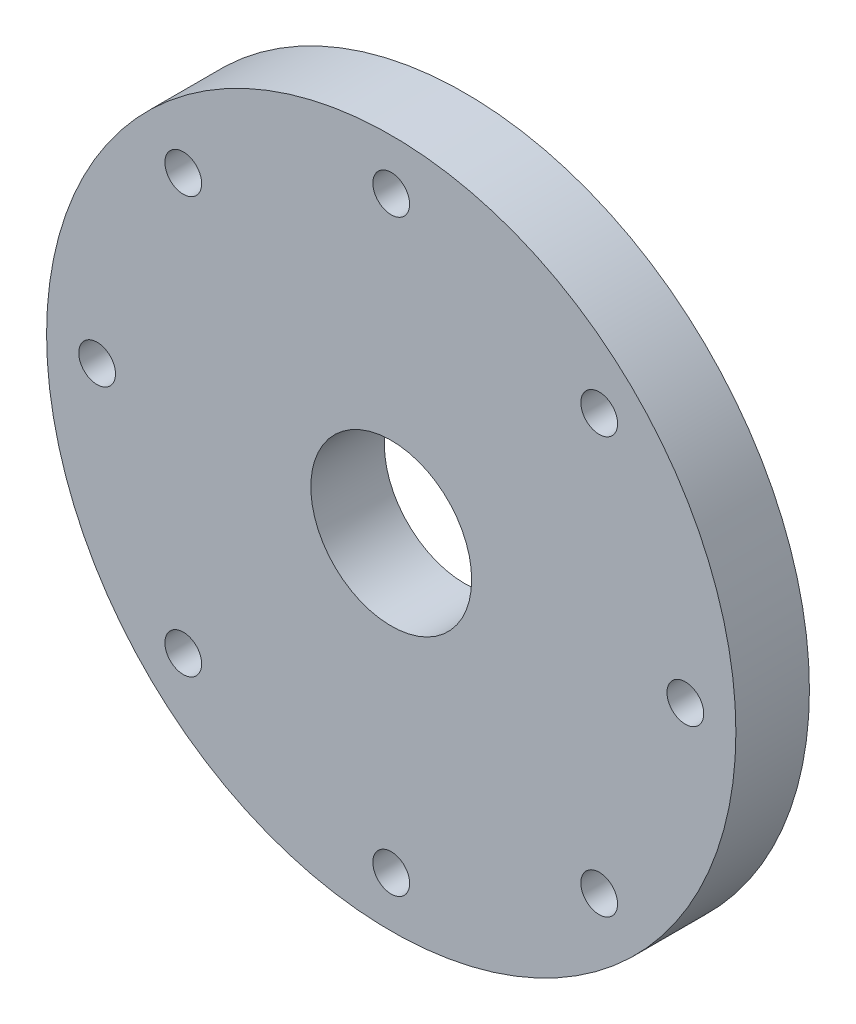
ISO-10303-21;
HEADER;
FILE_DESCRIPTION(('STEP AP214'),'2;1');
FILE_NAME('part.step','',(''),(''),'','','');
FILE_SCHEMA(('AUTOMOTIVE_DESIGN { 1 0 10303 214 1 1 1 1 }'));
ENDSEC;
DATA;
#1=APPLICATION_CONTEXT('core data for automotive mechanical design processes');
#2=APPLICATION_PROTOCOL_DEFINITION('international standard','automotive_design',2000,#1);
#3=PRODUCT_CONTEXT('',#1,'mechanical');
#4=PRODUCT('Part','Part','',(#3));
#5=PRODUCT_RELATED_PRODUCT_CATEGORY('part','',(#4));
#6=PRODUCT_DEFINITION_FORMATION('','',#4);
#7=PRODUCT_DEFINITION_CONTEXT('part definition',#1,'design');
#8=PRODUCT_DEFINITION('design','',#6,#7);
#9=PRODUCT_DEFINITION_SHAPE('','',#8);
#10=(LENGTH_UNIT() NAMED_UNIT(*) SI_UNIT(.MILLI.,.METRE.));
#11=(NAMED_UNIT(*) PLANE_ANGLE_UNIT() SI_UNIT($,.RADIAN.));
#12=(NAMED_UNIT(*) SI_UNIT($,.STERADIAN.) SOLID_ANGLE_UNIT());
#13=UNCERTAINTY_MEASURE_WITH_UNIT(LENGTH_MEASURE(1.E-05),#10,'distance_accuracy_value','');
#14=(GEOMETRIC_REPRESENTATION_CONTEXT(3) GLOBAL_UNCERTAINTY_ASSIGNED_CONTEXT((#13)) GLOBAL_UNIT_ASSIGNED_CONTEXT((#10,
#11,#12)) REPRESENTATION_CONTEXT('',''));
#15=CARTESIAN_POINT('',(0.,0.,0.));
#16=DIRECTION('',(0.,0.,1.));
#17=DIRECTION('',(1.,0.,0.));
#18=AXIS2_PLACEMENT_3D('',#15,#16,#17);
#19=CARTESIAN_POINT('',(0.,0.,14.));
#20=DIRECTION('',(0.,0.,1.));
#21=DIRECTION('',(1.,0.,0.));
#22=AXIS2_PLACEMENT_3D('',#19,#20,#21);
#23=CYLINDRICAL_SURFACE('',#22,75.);
#24=CARTESIAN_POINT('',(0.,0.,14.));
#25=DIRECTION('',(0.,0.,1.));
#26=DIRECTION('',(1.,0.,0.));
#27=AXIS2_PLACEMENT_3D('',#24,#25,#26);
#28=CIRCLE('',#27,75.);
#29=CARTESIAN_POINT('',(75.,0.,14.));
#30=VERTEX_POINT('',#29);
#31=EDGE_CURVE('E10',#30,#30,#28,.T.);
#32=ORIENTED_EDGE('',*,*,#31,.T.);
#33=EDGE_LOOP('',(#32));
#34=FACE_BOUND('',#33,.T.);
#35=CARTESIAN_POINT('',(0.,0.,30.));
#36=DIRECTION('',(0.,0.,1.));
#37=DIRECTION('',(1.,0.,0.));
#38=AXIS2_PLACEMENT_3D('',#35,#36,#37);
#39=CIRCLE('',#38,75.);
#40=CARTESIAN_POINT('',(75.,0.,30.));
#41=VERTEX_POINT('',#40);
#42=EDGE_CURVE('E37',#41,#41,#39,.T.);
#43=ORIENTED_EDGE('',*,*,#42,.F.);
#44=EDGE_LOOP('',(#43));
#45=FACE_BOUND('',#44,.T.);
#46=ADVANCED_FACE('F31',(#34,#45),#23,.T.);
#47=CARTESIAN_POINT('',(75.,0.,14.));
#48=DIRECTION('',(0.,0.,-1.));
#49=DIRECTION('',(-1.,0.,0.));
#50=AXIS2_PLACEMENT_3D('',#47,#48,#49);
#51=PLANE('',#50);
#52=CARTESIAN_POINT('',(0.,0.,14.));
#53=DIRECTION('',(0.,0.,-1.));
#54=DIRECTION('',(-1.,0.,0.));
#55=AXIS2_PLACEMENT_3D('',#52,#53,#54);
#56=CIRCLE('',#55,17.5);
#57=CARTESIAN_POINT('',(-17.5,0.,14.));
#58=VERTEX_POINT('',#57);
#59=EDGE_CURVE('E92',#58,#58,#56,.T.);
#60=ORIENTED_EDGE('',*,*,#59,.F.);
#61=EDGE_LOOP('',(#60));
#62=FACE_BOUND('',#61,.T.);
#63=CARTESIAN_POINT('',(0.,64.,14.));
#64=DIRECTION('',(0.,0.,-1.));
#65=DIRECTION('',(-1.,0.,0.));
#66=AXIS2_PLACEMENT_3D('',#63,#64,#65);
#67=CIRCLE('',#66,4.);
#68=CARTESIAN_POINT('',(-4.00000000000001,64.,14.));
#69=VERTEX_POINT('',#68);
#70=EDGE_CURVE('E86',#69,#69,#67,.T.);
#71=ORIENTED_EDGE('',*,*,#70,.F.);
#72=EDGE_LOOP('',(#71));
#73=FACE_BOUND('',#72,.T.);
#74=CARTESIAN_POINT('',(0.,-64.,14.));
#75=DIRECTION('',(0.,0.,-1.));
#76=DIRECTION('',(-1.,0.,0.));
#77=AXIS2_PLACEMENT_3D('',#74,#75,#76);
#78=CIRCLE('',#77,4.);
#79=CARTESIAN_POINT('',(-4.,-64.,14.));
#80=VERTEX_POINT('',#79);
#81=EDGE_CURVE('E80',#80,#80,#78,.T.);
#82=ORIENTED_EDGE('',*,*,#81,.F.);
#83=EDGE_LOOP('',(#82));
#84=FACE_BOUND('',#83,.T.);
#85=CARTESIAN_POINT('',(64.,0.,14.));
#86=DIRECTION('',(0.,0.,-1.));
#87=DIRECTION('',(-1.,0.,0.));
#88=AXIS2_PLACEMENT_3D('',#85,#86,#87);
#89=CIRCLE('',#88,4.);
#90=CARTESIAN_POINT('',(60.,0.,14.));
#91=VERTEX_POINT('',#90);
#92=EDGE_CURVE('E74',#91,#91,#89,.T.);
#93=ORIENTED_EDGE('',*,*,#92,.F.);
#94=EDGE_LOOP('',(#93));
#95=FACE_BOUND('',#94,.T.);
#96=CARTESIAN_POINT('',(-64.,0.,14.));
#97=DIRECTION('',(0.,0.,-1.));
#98=DIRECTION('',(-1.,0.,0.));
#99=AXIS2_PLACEMENT_3D('',#96,#97,#98);
#100=CIRCLE('',#99,4.);
#101=CARTESIAN_POINT('',(-68.,0.,14.));
#102=VERTEX_POINT('',#101);
#103=EDGE_CURVE('E68',#102,#102,#100,.T.);
#104=ORIENTED_EDGE('',*,*,#103,.F.);
#105=EDGE_LOOP('',(#104));
#106=FACE_BOUND('',#105,.T.);
#107=CARTESIAN_POINT('',(-45.254833995939,45.2548339959391,14.));
#108=DIRECTION('',(0.,0.,-1.));
#109=DIRECTION('',(-1.,0.,0.));
#110=AXIS2_PLACEMENT_3D('',#107,#108,#109);
#111=CIRCLE('',#110,4.);
#112=CARTESIAN_POINT('',(-49.254833995939,45.2548339959391,14.));
#113=VERTEX_POINT('',#112);
#114=EDGE_CURVE('E65',#113,#113,#111,.T.);
#115=ORIENTED_EDGE('',*,*,#114,.F.);
#116=EDGE_LOOP('',(#115));
#117=FACE_BOUND('',#116,.T.);
#118=CARTESIAN_POINT('',(45.2548339959391,45.254833995939,14.));
#119=DIRECTION('',(0.,0.,-1.));
#120=DIRECTION('',(-1.,0.,0.));
#121=AXIS2_PLACEMENT_3D('',#118,#119,#120);
#122=CIRCLE('',#121,4.);
#123=CARTESIAN_POINT('',(41.2548339959391,45.254833995939,14.));
#124=VERTEX_POINT('',#123);
#125=EDGE_CURVE('E59',#124,#124,#122,.T.);
#126=ORIENTED_EDGE('',*,*,#125,.F.);
#127=EDGE_LOOP('',(#126));
#128=FACE_BOUND('',#127,.T.);
#129=CARTESIAN_POINT('',(45.254833995939,-45.2548339959391,14.));
#130=DIRECTION('',(0.,0.,-1.));
#131=DIRECTION('',(-1.,0.,0.));
#132=AXIS2_PLACEMENT_3D('',#129,#130,#131);
#133=CIRCLE('',#132,4.);
#134=CARTESIAN_POINT('',(41.254833995939,-45.2548339959391,14.));
#135=VERTEX_POINT('',#134);
#136=EDGE_CURVE('E53',#135,#135,#133,.T.);
#137=ORIENTED_EDGE('',*,*,#136,.F.);
#138=EDGE_LOOP('',(#137));
#139=FACE_BOUND('',#138,.T.);
#140=CARTESIAN_POINT('',(-45.2548339959391,-45.254833995939,14.));
#141=DIRECTION('',(0.,0.,-1.));
#142=DIRECTION('',(-1.,0.,0.));
#143=AXIS2_PLACEMENT_3D('',#140,#141,#142);
#144=CIRCLE('',#143,4.);
#145=CARTESIAN_POINT('',(-49.2548339959391,-45.254833995939,14.));
#146=VERTEX_POINT('',#145);
#147=EDGE_CURVE('E45',#146,#146,#144,.T.);
#148=ORIENTED_EDGE('',*,*,#147,.F.);
#149=EDGE_LOOP('',(#148));
#150=FACE_BOUND('',#149,.T.);
#151=ORIENTED_EDGE('',*,*,#31,.F.);
#152=EDGE_LOOP('',(#151));
#153=FACE_BOUND('',#152,.T.);
#154=ADVANCED_FACE('F105',(#62,#73,#84,#95,#106,#117,#128,#139,#150,#153),#51,.T.);
#155=CARTESIAN_POINT('',(0.,0.,30.));
#156=DIRECTION('',(0.,0.,1.));
#157=DIRECTION('',(1.,0.,0.));
#158=AXIS2_PLACEMENT_3D('',#155,#156,#157);
#159=PLANE('',#158);
#160=CARTESIAN_POINT('',(0.,0.,30.));
#161=DIRECTION('',(0.,0.,1.));
#162=DIRECTION('',(1.,0.,0.));
#163=AXIS2_PLACEMENT_3D('',#160,#161,#162);
#164=CIRCLE('',#163,17.5);
#165=CARTESIAN_POINT('',(17.5,0.,30.));
#166=VERTEX_POINT('',#165);
#167=EDGE_CURVE('E95',#166,#166,#164,.T.);
#168=ORIENTED_EDGE('',*,*,#167,.F.);
#169=EDGE_LOOP('',(#168));
#170=FACE_BOUND('',#169,.T.);
#171=CARTESIAN_POINT('',(0.,64.,30.));
#172=DIRECTION('',(0.,0.,1.));
#173=DIRECTION('',(1.,0.,0.));
#174=AXIS2_PLACEMENT_3D('',#171,#172,#173);
#175=CIRCLE('',#174,4.);
#176=CARTESIAN_POINT('',(3.99999999999998,64.,30.));
#177=VERTEX_POINT('',#176);
#178=EDGE_CURVE('E89',#177,#177,#175,.T.);
#179=ORIENTED_EDGE('',*,*,#178,.F.);
#180=EDGE_LOOP('',(#179));
#181=FACE_BOUND('',#180,.T.);
#182=CARTESIAN_POINT('',(0.,-64.,30.));
#183=DIRECTION('',(0.,0.,1.));
#184=DIRECTION('',(1.,0.,0.));
#185=AXIS2_PLACEMENT_3D('',#182,#183,#184);
#186=CIRCLE('',#185,4.);
#187=CARTESIAN_POINT('',(4.,-64.,30.));
#188=VERTEX_POINT('',#187);
#189=EDGE_CURVE('E83',#188,#188,#186,.T.);
#190=ORIENTED_EDGE('',*,*,#189,.F.);
#191=EDGE_LOOP('',(#190));
#192=FACE_BOUND('',#191,.T.);
#193=CARTESIAN_POINT('',(64.,0.,30.));
#194=DIRECTION('',(0.,0.,1.));
#195=DIRECTION('',(1.,0.,0.));
#196=AXIS2_PLACEMENT_3D('',#193,#194,#195);
#197=CIRCLE('',#196,4.);
#198=CARTESIAN_POINT('',(68.,0.,30.));
#199=VERTEX_POINT('',#198);
#200=EDGE_CURVE('E77',#199,#199,#197,.T.);
#201=ORIENTED_EDGE('',*,*,#200,.F.);
#202=EDGE_LOOP('',(#201));
#203=FACE_BOUND('',#202,.T.);
#204=CARTESIAN_POINT('',(-64.,0.,30.));
#205=DIRECTION('',(0.,0.,1.));
#206=DIRECTION('',(1.,0.,0.));
#207=AXIS2_PLACEMENT_3D('',#204,#205,#206);
#208=CIRCLE('',#207,4.);
#209=CARTESIAN_POINT('',(-60.,0.,30.));
#210=VERTEX_POINT('',#209);
#211=EDGE_CURVE('E71',#210,#210,#208,.T.);
#212=ORIENTED_EDGE('',*,*,#211,.F.);
#213=EDGE_LOOP('',(#212));
#214=FACE_BOUND('',#213,.T.);
#215=CARTESIAN_POINT('',(-45.254833995939,45.2548339959391,30.));
#216=DIRECTION('',(0.,0.,1.));
#217=DIRECTION('',(1.,0.,0.));
#218=AXIS2_PLACEMENT_3D('',#215,#216,#217);
#219=CIRCLE('',#218,4.);
#220=CARTESIAN_POINT('',(-41.254833995939,45.2548339959391,30.));
#221=VERTEX_POINT('',#220);
#222=EDGE_CURVE('E62',#221,#221,#219,.T.);
#223=ORIENTED_EDGE('',*,*,#222,.F.);
#224=EDGE_LOOP('',(#223));
#225=FACE_BOUND('',#224,.T.);
#226=CARTESIAN_POINT('',(45.2548339959391,45.254833995939,30.));
#227=DIRECTION('',(0.,0.,1.));
#228=DIRECTION('',(1.,0.,0.));
#229=AXIS2_PLACEMENT_3D('',#226,#227,#228);
#230=CIRCLE('',#229,4.);
#231=CARTESIAN_POINT('',(49.2548339959391,45.254833995939,30.));
#232=VERTEX_POINT('',#231);
#233=EDGE_CURVE('E56',#232,#232,#230,.T.);
#234=ORIENTED_EDGE('',*,*,#233,.F.);
#235=EDGE_LOOP('',(#234));
#236=FACE_BOUND('',#235,.T.);
#237=CARTESIAN_POINT('',(45.254833995939,-45.2548339959391,30.));
#238=DIRECTION('',(0.,0.,1.));
#239=DIRECTION('',(1.,0.,0.));
#240=AXIS2_PLACEMENT_3D('',#237,#238,#239);
#241=CIRCLE('',#240,4.);
#242=CARTESIAN_POINT('',(49.254833995939,-45.2548339959391,30.));
#243=VERTEX_POINT('',#242);
#244=EDGE_CURVE('E50',#243,#243,#241,.T.);
#245=ORIENTED_EDGE('',*,*,#244,.F.);
#246=EDGE_LOOP('',(#245));
#247=FACE_BOUND('',#246,.T.);
#248=CARTESIAN_POINT('',(-45.2548339959391,-45.254833995939,30.));
#249=DIRECTION('',(0.,0.,1.));
#250=DIRECTION('',(1.,0.,0.));
#251=AXIS2_PLACEMENT_3D('',#248,#249,#250);
#252=CIRCLE('',#251,4.);
#253=CARTESIAN_POINT('',(-41.2548339959391,-45.254833995939,30.));
#254=VERTEX_POINT('',#253);
#255=EDGE_CURVE('E41',#254,#254,#252,.T.);
#256=ORIENTED_EDGE('',*,*,#255,.F.);
#257=EDGE_LOOP('',(#256));
#258=FACE_BOUND('',#257,.T.);
#259=ORIENTED_EDGE('',*,*,#42,.T.);
#260=EDGE_LOOP('',(#259));
#261=FACE_BOUND('',#260,.T.);
#262=ADVANCED_FACE('F101',(#170,#181,#192,#203,#214,#225,#236,#247,#258,#261),#159,.T.);
#263=CARTESIAN_POINT('',(-45.2548339959391,-45.254833995939,14.));
#264=DIRECTION('',(0.,0.,-1.));
#265=DIRECTION('',(-1.,0.,0.));
#266=AXIS2_PLACEMENT_3D('',#263,#264,#265);
#267=CYLINDRICAL_SURFACE('',#266,4.);
#268=ORIENTED_EDGE('',*,*,#255,.T.);
#269=EDGE_LOOP('',(#268));
#270=FACE_BOUND('',#269,.T.);
#271=ORIENTED_EDGE('',*,*,#147,.T.);
#272=EDGE_LOOP('',(#271));
#273=FACE_BOUND('',#272,.T.);
#274=ADVANCED_FACE('F104',(#270,#273),#267,.F.);
#275=CARTESIAN_POINT('',(45.254833995939,-45.2548339959391,14.));
#276=DIRECTION('',(0.,0.,-1.));
#277=DIRECTION('',(-1.,0.,0.));
#278=AXIS2_PLACEMENT_3D('',#275,#276,#277);
#279=CYLINDRICAL_SURFACE('',#278,4.);
#280=ORIENTED_EDGE('',*,*,#244,.T.);
#281=EDGE_LOOP('',(#280));
#282=FACE_BOUND('',#281,.T.);
#283=ORIENTED_EDGE('',*,*,#136,.T.);
#284=EDGE_LOOP('',(#283));
#285=FACE_BOUND('',#284,.T.);
#286=ADVANCED_FACE('F125',(#282,#285),#279,.F.);
#287=CARTESIAN_POINT('',(45.2548339959391,45.254833995939,14.));
#288=DIRECTION('',(0.,0.,-1.));
#289=DIRECTION('',(-1.,0.,0.));
#290=AXIS2_PLACEMENT_3D('',#287,#288,#289);
#291=CYLINDRICAL_SURFACE('',#290,4.);
#292=ORIENTED_EDGE('',*,*,#233,.T.);
#293=EDGE_LOOP('',(#292));
#294=FACE_BOUND('',#293,.T.);
#295=ORIENTED_EDGE('',*,*,#125,.T.);
#296=EDGE_LOOP('',(#295));
#297=FACE_BOUND('',#296,.T.);
#298=ADVANCED_FACE('F140',(#294,#297),#291,.F.);
#299=CARTESIAN_POINT('',(-45.254833995939,45.2548339959391,14.));
#300=DIRECTION('',(0.,0.,-1.));
#301=DIRECTION('',(-1.,0.,0.));
#302=AXIS2_PLACEMENT_3D('',#299,#300,#301);
#303=CYLINDRICAL_SURFACE('',#302,4.);
#304=ORIENTED_EDGE('',*,*,#222,.T.);
#305=EDGE_LOOP('',(#304));
#306=FACE_BOUND('',#305,.T.);
#307=ORIENTED_EDGE('',*,*,#114,.T.);
#308=EDGE_LOOP('',(#307));
#309=FACE_BOUND('',#308,.T.);
#310=ADVANCED_FACE('F144',(#306,#309),#303,.F.);
#311=CARTESIAN_POINT('',(-64.,0.,30.));
#312=DIRECTION('',(0.,0.,1.));
#313=DIRECTION('',(1.,0.,0.));
#314=AXIS2_PLACEMENT_3D('',#311,#312,#313);
#315=CYLINDRICAL_SURFACE('',#314,4.);
#316=ORIENTED_EDGE('',*,*,#103,.T.);
#317=EDGE_LOOP('',(#316));
#318=FACE_BOUND('',#317,.T.);
#319=ORIENTED_EDGE('',*,*,#211,.T.);
#320=EDGE_LOOP('',(#319));
#321=FACE_BOUND('',#320,.T.);
#322=ADVANCED_FACE('F148',(#318,#321),#315,.F.);
#323=CARTESIAN_POINT('',(64.,0.,30.));
#324=DIRECTION('',(0.,0.,1.));
#325=DIRECTION('',(1.,0.,0.));
#326=AXIS2_PLACEMENT_3D('',#323,#324,#325);
#327=CYLINDRICAL_SURFACE('',#326,4.);
#328=ORIENTED_EDGE('',*,*,#92,.T.);
#329=EDGE_LOOP('',(#328));
#330=FACE_BOUND('',#329,.T.);
#331=ORIENTED_EDGE('',*,*,#200,.T.);
#332=EDGE_LOOP('',(#331));
#333=FACE_BOUND('',#332,.T.);
#334=ADVANCED_FACE('F152',(#330,#333),#327,.F.);
#335=CARTESIAN_POINT('',(0.,-64.,30.));
#336=DIRECTION('',(0.,0.,1.));
#337=DIRECTION('',(1.,0.,0.));
#338=AXIS2_PLACEMENT_3D('',#335,#336,#337);
#339=CYLINDRICAL_SURFACE('',#338,4.);
#340=ORIENTED_EDGE('',*,*,#81,.T.);
#341=EDGE_LOOP('',(#340));
#342=FACE_BOUND('',#341,.T.);
#343=ORIENTED_EDGE('',*,*,#189,.T.);
#344=EDGE_LOOP('',(#343));
#345=FACE_BOUND('',#344,.T.);
#346=ADVANCED_FACE('F156',(#342,#345),#339,.F.);
#347=CARTESIAN_POINT('',(0.,64.,30.));
#348=DIRECTION('',(0.,0.,1.));
#349=DIRECTION('',(1.,0.,0.));
#350=AXIS2_PLACEMENT_3D('',#347,#348,#349);
#351=CYLINDRICAL_SURFACE('',#350,4.);
#352=ORIENTED_EDGE('',*,*,#70,.T.);
#353=EDGE_LOOP('',(#352));
#354=FACE_BOUND('',#353,.T.);
#355=ORIENTED_EDGE('',*,*,#178,.T.);
#356=EDGE_LOOP('',(#355));
#357=FACE_BOUND('',#356,.T.);
#358=ADVANCED_FACE('F160',(#354,#357),#351,.F.);
#359=CARTESIAN_POINT('',(0.,0.,0.));
#360=DIRECTION('',(0.,0.,1.));
#361=DIRECTION('',(1.,0.,0.));
#362=AXIS2_PLACEMENT_3D('',#359,#360,#361);
#363=CYLINDRICAL_SURFACE('',#362,17.5);
#364=ORIENTED_EDGE('',*,*,#59,.T.);
#365=EDGE_LOOP('',(#364));
#366=FACE_BOUND('',#365,.T.);
#367=ORIENTED_EDGE('',*,*,#167,.T.);
#368=EDGE_LOOP('',(#367));
#369=FACE_BOUND('',#368,.T.);
#370=ADVANCED_FACE('F99',(#366,#369),#363,.F.);
#371=CLOSED_SHELL('',(#46,#154,#262,#274,#286,#298,#310,#322,#334,#346,#358,#370));
#372=MANIFOLD_SOLID_BREP('B2',#371);
#373=ADVANCED_BREP_SHAPE_REPRESENTATION('',(#18,#372),#14);
#374=SHAPE_DEFINITION_REPRESENTATION(#9,#373);
ENDSEC;
END-ISO-10303-21;
